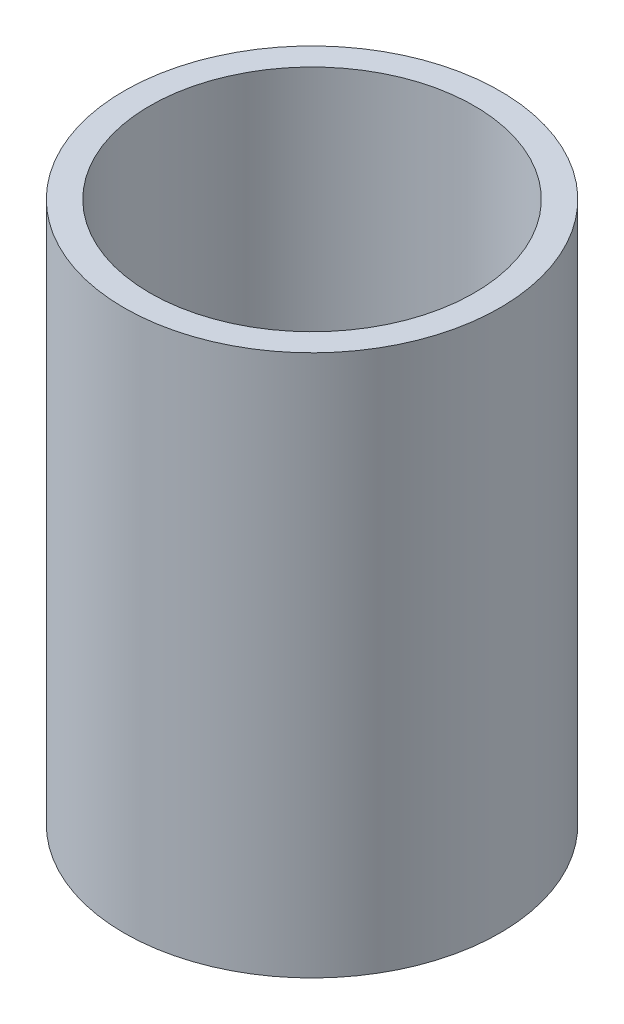
ISO-10303-21;
HEADER;
FILE_DESCRIPTION(('STEP AP214'),'2;1');
FILE_NAME('part.step','',(''),(''),'','','');
FILE_SCHEMA(('AUTOMOTIVE_DESIGN { 1 0 10303 214 1 1 1 1 }'));
ENDSEC;
DATA;
#1=APPLICATION_CONTEXT('core data for automotive mechanical design processes');
#2=APPLICATION_PROTOCOL_DEFINITION('international standard','automotive_design',2000,#1);
#3=PRODUCT_CONTEXT('',#1,'mechanical');
#4=PRODUCT('Part','Part','',(#3));
#5=PRODUCT_RELATED_PRODUCT_CATEGORY('part','',(#4));
#6=PRODUCT_DEFINITION_FORMATION('','',#4);
#7=PRODUCT_DEFINITION_CONTEXT('part definition',#1,'design');
#8=PRODUCT_DEFINITION('design','',#6,#7);
#9=PRODUCT_DEFINITION_SHAPE('','',#8);
#10=(LENGTH_UNIT() NAMED_UNIT(*) SI_UNIT(.MILLI.,.METRE.));
#11=(NAMED_UNIT(*) PLANE_ANGLE_UNIT() SI_UNIT($,.RADIAN.));
#12=(NAMED_UNIT(*) SI_UNIT($,.STERADIAN.) SOLID_ANGLE_UNIT());
#13=UNCERTAINTY_MEASURE_WITH_UNIT(LENGTH_MEASURE(1.E-05),#10,'distance_accuracy_value','');
#14=(GEOMETRIC_REPRESENTATION_CONTEXT(3) GLOBAL_UNCERTAINTY_ASSIGNED_CONTEXT((#13)) GLOBAL_UNIT_ASSIGNED_CONTEXT((#10,
#11,#12)) REPRESENTATION_CONTEXT('',''));
#15=CARTESIAN_POINT('',(0.,0.,0.));
#16=DIRECTION('',(0.,0.,1.));
#17=DIRECTION('',(1.,0.,0.));
#18=AXIS2_PLACEMENT_3D('',#15,#16,#17);
#19=CARTESIAN_POINT('',(0.,55.,0.));
#20=DIRECTION('',(0.,1.,0.));
#21=DIRECTION('',(0.,0.,1.));
#22=AXIS2_PLACEMENT_3D('',#19,#20,#21);
#23=CYLINDRICAL_SURFACE('',#22,46.28515);
#24=CARTESIAN_POINT('',(0.,-87.732365567385,0.));
#25=DIRECTION('',(0.,1.,0.));
#26=DIRECTION('',(0.,0.,1.));
#27=AXIS2_PLACEMENT_3D('',#24,#25,#26);
#28=CIRCLE('',#27,46.28515);
#29=CARTESIAN_POINT('',(0.,-87.732365567385,46.28515));
#30=VERTEX_POINT('',#29);
#31=EDGE_CURVE('E10',#30,#30,#28,.T.);
#32=ORIENTED_EDGE('',*,*,#31,.T.);
#33=EDGE_LOOP('',(#32));
#34=FACE_BOUND('',#33,.T.);
#35=CARTESIAN_POINT('',(0.,45.6176344326149,0.));
#36=DIRECTION('',(0.,1.,0.));
#37=DIRECTION('',(0.,0.,1.));
#38=AXIS2_PLACEMENT_3D('',#35,#36,#37);
#39=CIRCLE('',#38,46.28515);
#40=CARTESIAN_POINT('',(0.,45.6176344326149,46.28515));
#41=VERTEX_POINT('',#40);
#42=EDGE_CURVE('E45',#41,#41,#39,.T.);
#43=ORIENTED_EDGE('',*,*,#42,.F.);
#44=EDGE_LOOP('',(#43));
#45=FACE_BOUND('',#44,.T.);
#46=ADVANCED_FACE('F31',(#34,#45),#23,.T.);
#47=CARTESIAN_POINT('',(-46.28515,-87.7323655673851,0.));
#48=DIRECTION('',(0.,-1.,0.));
#49=DIRECTION('',(0.,0.,-1.));
#50=AXIS2_PLACEMENT_3D('',#47,#48,#49);
#51=PLANE('',#50);
#52=CARTESIAN_POINT('',(0.,-87.732365567385,0.));
#53=DIRECTION('',(0.,1.,0.));
#54=DIRECTION('',(0.,0.,1.));
#55=AXIS2_PLACEMENT_3D('',#52,#53,#54);
#56=CIRCLE('',#55,39.93515);
#57=CARTESIAN_POINT('',(0.,-87.732365567385,39.93515));
#58=VERTEX_POINT('',#57);
#59=EDGE_CURVE('E37',#58,#58,#56,.T.);
#60=ORIENTED_EDGE('',*,*,#59,.T.);
#61=EDGE_LOOP('',(#60));
#62=FACE_BOUND('',#61,.T.);
#63=ORIENTED_EDGE('',*,*,#31,.F.);
#64=EDGE_LOOP('',(#63));
#65=FACE_BOUND('',#64,.T.);
#66=ADVANCED_FACE('F55',(#62,#65),#51,.T.);
#67=CARTESIAN_POINT('',(0.,55.,0.));
#68=DIRECTION('',(0.,1.,0.));
#69=DIRECTION('',(0.,0.,1.));
#70=AXIS2_PLACEMENT_3D('',#67,#68,#69);
#71=CYLINDRICAL_SURFACE('',#70,39.93515);
#72=CARTESIAN_POINT('',(0.,45.6176344326149,0.));
#73=DIRECTION('',(0.,1.,0.));
#74=DIRECTION('',(0.,0.,1.));
#75=AXIS2_PLACEMENT_3D('',#72,#73,#74);
#76=CIRCLE('',#75,39.93515);
#77=CARTESIAN_POINT('',(0.,45.6176344326149,39.93515));
#78=VERTEX_POINT('',#77);
#79=EDGE_CURVE('E41',#78,#78,#76,.T.);
#80=ORIENTED_EDGE('',*,*,#79,.T.);
#81=EDGE_LOOP('',(#80));
#82=FACE_BOUND('',#81,.T.);
#83=ORIENTED_EDGE('',*,*,#59,.F.);
#84=EDGE_LOOP('',(#83));
#85=FACE_BOUND('',#84,.T.);
#86=ADVANCED_FACE('F59',(#82,#85),#71,.F.);
#87=CARTESIAN_POINT('',(-46.28515,45.6176344326149,0.));
#88=DIRECTION('',(0.,1.,0.));
#89=DIRECTION('',(0.,0.,1.));
#90=AXIS2_PLACEMENT_3D('',#87,#88,#89);
#91=PLANE('',#90);
#92=ORIENTED_EDGE('',*,*,#42,.T.);
#93=EDGE_LOOP('',(#92));
#94=FACE_BOUND('',#93,.T.);
#95=ORIENTED_EDGE('',*,*,#79,.F.);
#96=EDGE_LOOP('',(#95));
#97=FACE_BOUND('',#96,.T.);
#98=ADVANCED_FACE('F51',(#94,#97),#91,.T.);
#99=CLOSED_SHELL('',(#46,#66,#86,#98));
#100=MANIFOLD_SOLID_BREP('B2',#99);
#101=ADVANCED_BREP_SHAPE_REPRESENTATION('',(#18,#100),#14);
#102=SHAPE_DEFINITION_REPRESENTATION(#9,#101);
ENDSEC;
END-ISO-10303-21;
